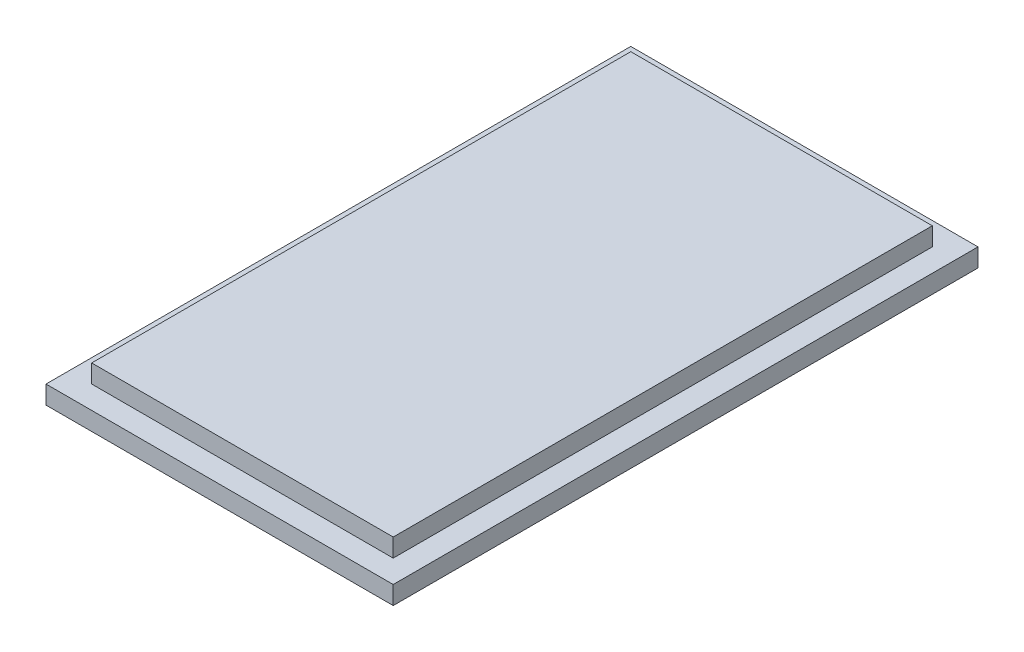
ISO-10303-21;
HEADER;
FILE_DESCRIPTION(('STEP AP214'),'2;1');
FILE_NAME('part.step','',(''),(''),'','','');
FILE_SCHEMA(('AUTOMOTIVE_DESIGN { 1 0 10303 214 1 1 1 1 }'));
ENDSEC;
DATA;
#1=APPLICATION_CONTEXT('core data for automotive mechanical design processes');
#2=APPLICATION_PROTOCOL_DEFINITION('international standard','automotive_design',2000,#1);
#3=PRODUCT_CONTEXT('',#1,'mechanical');
#4=PRODUCT('Part','Part','',(#3));
#5=PRODUCT_RELATED_PRODUCT_CATEGORY('part','',(#4));
#6=PRODUCT_DEFINITION_FORMATION('','',#4);
#7=PRODUCT_DEFINITION_CONTEXT('part definition',#1,'design');
#8=PRODUCT_DEFINITION('design','',#6,#7);
#9=PRODUCT_DEFINITION_SHAPE('','',#8);
#10=(LENGTH_UNIT() NAMED_UNIT(*) SI_UNIT(.MILLI.,.METRE.));
#11=(NAMED_UNIT(*) PLANE_ANGLE_UNIT() SI_UNIT($,.RADIAN.));
#12=(NAMED_UNIT(*) SI_UNIT($,.STERADIAN.) SOLID_ANGLE_UNIT());
#13=UNCERTAINTY_MEASURE_WITH_UNIT(LENGTH_MEASURE(1.E-05),#10,'distance_accuracy_value','');
#14=(GEOMETRIC_REPRESENTATION_CONTEXT(3) GLOBAL_UNCERTAINTY_ASSIGNED_CONTEXT((#13)) GLOBAL_UNIT_ASSIGNED_CONTEXT((#10,
#11,#12)) REPRESENTATION_CONTEXT('',''));
#15=CARTESIAN_POINT('',(0.,0.,0.));
#16=DIRECTION('',(0.,0.,1.));
#17=DIRECTION('',(1.,0.,0.));
#18=AXIS2_PLACEMENT_3D('',#15,#16,#17);
#19=CARTESIAN_POINT('',(0.,1.,0.));
#20=DIRECTION('',(0.,-1.,0.));
#21=DIRECTION('',(0.,0.,-1.));
#22=AXIS2_PLACEMENT_3D('',#19,#20,#21);
#23=PLANE('',#22);
#24=DIRECTION('',(0.,0.,1.));
#25=VECTOR('',#24,1.);
#26=CARTESIAN_POINT('',(0.,1.,0.));
#27=LINE('',#26,#25);
#28=CARTESIAN_POINT('',(0.,1.,-32.));
#29=VERTEX_POINT('',#28);
#30=CARTESIAN_POINT('',(0.,1.,0.));
#31=VERTEX_POINT('',#30);
#32=EDGE_CURVE('E173',#29,#31,#27,.T.);
#33=ORIENTED_EDGE('',*,*,#32,.T.);
#34=DIRECTION('',(1.,0.,0.));
#35=VECTOR('',#34,1.);
#36=CARTESIAN_POINT('',(0.,1.,0.));
#37=LINE('',#36,#35);
#38=CARTESIAN_POINT('',(19.,1.,0.));
#39=VERTEX_POINT('',#38);
#40=EDGE_CURVE('E90',#31,#39,#37,.T.);
#41=ORIENTED_EDGE('',*,*,#40,.T.);
#42=DIRECTION('',(0.,0.,-1.));
#43=VECTOR('',#42,1.);
#44=CARTESIAN_POINT('',(19.,1.,0.));
#45=LINE('',#44,#43);
#46=CARTESIAN_POINT('',(19.,1.,-32.));
#47=VERTEX_POINT('',#46);
#48=EDGE_CURVE('E178',#39,#47,#45,.T.);
#49=ORIENTED_EDGE('',*,*,#48,.T.);
#50=DIRECTION('',(-1.,0.,0.));
#51=VECTOR('',#50,1.);
#52=CARTESIAN_POINT('',(0.,1.,-32.));
#53=LINE('',#52,#51);
#54=EDGE_CURVE('E59',#47,#29,#53,.T.);
#55=ORIENTED_EDGE('',*,*,#54,.T.);
#56=EDGE_LOOP('',(#33,#41,#49,#55));
#57=FACE_BOUND('',#56,.T.);
#58=DIRECTION('',(1.,0.,0.));
#59=VECTOR('',#58,1.);
#60=CARTESIAN_POINT('',(1.25,1.,-1.25));
#61=LINE('',#60,#59);
#62=CARTESIAN_POINT('',(1.25,1.,-1.25));
#63=VERTEX_POINT('',#62);
#64=CARTESIAN_POINT('',(17.75,1.,-1.25));
#65=VERTEX_POINT('',#64);
#66=EDGE_CURVE('E129',#63,#65,#61,.T.);
#67=ORIENTED_EDGE('',*,*,#66,.F.);
#68=DIRECTION('',(0.,0.,1.));
#69=VECTOR('',#68,1.);
#70=CARTESIAN_POINT('',(1.25,1.,-1.25));
#71=LINE('',#70,#69);
#72=CARTESIAN_POINT('',(1.25,1.,-30.75));
#73=VERTEX_POINT('',#72);
#74=EDGE_CURVE('E125',#73,#63,#71,.T.);
#75=ORIENTED_EDGE('',*,*,#74,.F.);
#76=DIRECTION('',(-1.,0.,0.));
#77=VECTOR('',#76,1.);
#78=CARTESIAN_POINT('',(1.25,1.,-30.75));
#79=LINE('',#78,#77);
#80=CARTESIAN_POINT('',(17.75,1.,-30.75));
#81=VERTEX_POINT('',#80);
#82=EDGE_CURVE('E166',#81,#73,#79,.T.);
#83=ORIENTED_EDGE('',*,*,#82,.F.);
#84=DIRECTION('',(0.,0.,-1.));
#85=VECTOR('',#84,1.);
#86=CARTESIAN_POINT('',(17.75,1.,-1.25));
#87=LINE('',#86,#85);
#88=EDGE_CURVE('E162',#65,#81,#87,.T.);
#89=ORIENTED_EDGE('',*,*,#88,.F.);
#90=EDGE_LOOP('',(#67,#75,#83,#89));
#91=FACE_BOUND('',#90,.T.);
#92=ADVANCED_FACE('F41',(#57,#91),#23,.F.);
#93=CARTESIAN_POINT('',(0.,0.,0.));
#94=DIRECTION('',(0.,-1.,0.));
#95=DIRECTION('',(0.,0.,-1.));
#96=AXIS2_PLACEMENT_3D('',#93,#94,#95);
#97=PLANE('',#96);
#98=DIRECTION('',(0.,0.,1.));
#99=VECTOR('',#98,1.);
#100=CARTESIAN_POINT('',(0.,0.,0.));
#101=LINE('',#100,#99);
#102=CARTESIAN_POINT('',(0.,0.,-32.));
#103=VERTEX_POINT('',#102);
#104=CARTESIAN_POINT('',(0.,0.,0.));
#105=VERTEX_POINT('',#104);
#106=EDGE_CURVE('E172',#103,#105,#101,.T.);
#107=ORIENTED_EDGE('',*,*,#106,.F.);
#108=DIRECTION('',(-1.,0.,0.));
#109=VECTOR('',#108,1.);
#110=CARTESIAN_POINT('',(0.,0.,-32.));
#111=LINE('',#110,#109);
#112=CARTESIAN_POINT('',(19.,0.,-32.));
#113=VERTEX_POINT('',#112);
#114=EDGE_CURVE('E83',#113,#103,#111,.T.);
#115=ORIENTED_EDGE('',*,*,#114,.F.);
#116=DIRECTION('',(0.,0.,-1.));
#117=VECTOR('',#116,1.);
#118=CARTESIAN_POINT('',(19.,0.,0.));
#119=LINE('',#118,#117);
#120=CARTESIAN_POINT('',(19.,0.,0.));
#121=VERTEX_POINT('',#120);
#122=EDGE_CURVE('E77',#121,#113,#119,.T.);
#123=ORIENTED_EDGE('',*,*,#122,.F.);
#124=DIRECTION('',(1.,0.,0.));
#125=VECTOR('',#124,1.);
#126=CARTESIAN_POINT('',(0.,0.,0.));
#127=LINE('',#126,#125);
#128=EDGE_CURVE('E187',#105,#121,#127,.T.);
#129=ORIENTED_EDGE('',*,*,#128,.F.);
#130=EDGE_LOOP('',(#107,#115,#123,#129));
#131=FACE_BOUND('',#130,.T.);
#132=ADVANCED_FACE('F203',(#131),#97,.T.);
#133=CARTESIAN_POINT('',(0.,1.,0.));
#134=DIRECTION('',(1.,0.,0.));
#135=DIRECTION('',(0.,0.,-1.));
#136=AXIS2_PLACEMENT_3D('',#133,#134,#135);
#137=PLANE('',#136);
#138=ORIENTED_EDGE('',*,*,#106,.T.);
#139=DIRECTION('',(0.,-1.,0.));
#140=VECTOR('',#139,1.);
#141=CARTESIAN_POINT('',(0.,1.,0.));
#142=LINE('',#141,#140);
#143=EDGE_CURVE('E11',#31,#105,#142,.T.);
#144=ORIENTED_EDGE('',*,*,#143,.F.);
#145=ORIENTED_EDGE('',*,*,#32,.F.);
#146=DIRECTION('',(0.,-1.,0.));
#147=VECTOR('',#146,1.);
#148=CARTESIAN_POINT('',(0.,1.,-32.));
#149=LINE('',#148,#147);
#150=EDGE_CURVE('E183',#29,#103,#149,.T.);
#151=ORIENTED_EDGE('',*,*,#150,.T.);
#152=EDGE_LOOP('',(#138,#144,#145,#151));
#153=FACE_BOUND('',#152,.T.);
#154=ADVANCED_FACE('F43',(#153),#137,.F.);
#155=CARTESIAN_POINT('',(0.,1.,0.));
#156=DIRECTION('',(0.,0.,-1.));
#157=DIRECTION('',(-1.,0.,0.));
#158=AXIS2_PLACEMENT_3D('',#155,#156,#157);
#159=PLANE('',#158);
#160=ORIENTED_EDGE('',*,*,#128,.T.);
#161=DIRECTION('',(0.,-1.,0.));
#162=VECTOR('',#161,1.);
#163=CARTESIAN_POINT('',(19.,1.,0.));
#164=LINE('',#163,#162);
#165=EDGE_CURVE('E51',#39,#121,#164,.T.);
#166=ORIENTED_EDGE('',*,*,#165,.F.);
#167=ORIENTED_EDGE('',*,*,#40,.F.);
#168=ORIENTED_EDGE('',*,*,#143,.T.);
#169=EDGE_LOOP('',(#160,#166,#167,#168));
#170=FACE_BOUND('',#169,.T.);
#171=ADVANCED_FACE('F216',(#170),#159,.F.);
#172=CARTESIAN_POINT('',(19.,1.,0.));
#173=DIRECTION('',(-1.,0.,0.));
#174=DIRECTION('',(0.,0.,1.));
#175=AXIS2_PLACEMENT_3D('',#172,#173,#174);
#176=PLANE('',#175);
#177=ORIENTED_EDGE('',*,*,#122,.T.);
#178=DIRECTION('',(0.,-1.,0.));
#179=VECTOR('',#178,1.);
#180=CARTESIAN_POINT('',(19.,1.,-32.));
#181=LINE('',#180,#179);
#182=EDGE_CURVE('E196',#47,#113,#181,.T.);
#183=ORIENTED_EDGE('',*,*,#182,.F.);
#184=ORIENTED_EDGE('',*,*,#48,.F.);
#185=ORIENTED_EDGE('',*,*,#165,.T.);
#186=EDGE_LOOP('',(#177,#183,#184,#185));
#187=FACE_BOUND('',#186,.T.);
#188=ADVANCED_FACE('F200',(#187),#176,.F.);
#189=CARTESIAN_POINT('',(0.,1.,-32.));
#190=DIRECTION('',(0.,0.,1.));
#191=DIRECTION('',(1.,0.,0.));
#192=AXIS2_PLACEMENT_3D('',#189,#190,#191);
#193=PLANE('',#192);
#194=ORIENTED_EDGE('',*,*,#114,.T.);
#195=ORIENTED_EDGE('',*,*,#150,.F.);
#196=ORIENTED_EDGE('',*,*,#54,.F.);
#197=ORIENTED_EDGE('',*,*,#182,.T.);
#198=EDGE_LOOP('',(#194,#195,#196,#197));
#199=FACE_BOUND('',#198,.T.);
#200=ADVANCED_FACE('F207',(#199),#193,.F.);
#201=CARTESIAN_POINT('',(1.25,2.,0.));
#202=DIRECTION('',(-1.,0.,0.));
#203=DIRECTION('',(0.,0.,1.));
#204=AXIS2_PLACEMENT_3D('',#201,#202,#203);
#205=PLANE('',#204);
#206=ORIENTED_EDGE('',*,*,#74,.T.);
#207=DIRECTION('',(0.,-1.,0.));
#208=VECTOR('',#207,1.);
#209=CARTESIAN_POINT('',(1.25,2.,-1.25));
#210=LINE('',#209,#208);
#211=CARTESIAN_POINT('',(1.25,2.,-1.25));
#212=VERTEX_POINT('',#211);
#213=EDGE_CURVE('E118',#212,#63,#210,.T.);
#214=ORIENTED_EDGE('',*,*,#213,.F.);
#215=DIRECTION('',(0.,0.,-1.));
#216=VECTOR('',#215,1.);
#217=CARTESIAN_POINT('',(1.25,2.,0.));
#218=LINE('',#217,#216);
#219=CARTESIAN_POINT('',(1.25,2.,-30.75));
#220=VERTEX_POINT('',#219);
#221=EDGE_CURVE('E123',#212,#220,#218,.T.);
#222=ORIENTED_EDGE('',*,*,#221,.T.);
#223=DIRECTION('',(0.,-1.,0.));
#224=VECTOR('',#223,1.);
#225=CARTESIAN_POINT('',(1.25,2.,-30.75));
#226=LINE('',#225,#224);
#227=EDGE_CURVE('E151',#220,#73,#226,.T.);
#228=ORIENTED_EDGE('',*,*,#227,.T.);
#229=EDGE_LOOP('',(#206,#214,#222,#228));
#230=FACE_BOUND('',#229,.T.);
#231=ADVANCED_FACE('F120',(#230),#205,.T.);
#232=CARTESIAN_POINT('',(17.75,2.,0.));
#233=DIRECTION('',(-1.,0.,0.));
#234=DIRECTION('',(0.,0.,1.));
#235=AXIS2_PLACEMENT_3D('',#232,#233,#234);
#236=PLANE('',#235);
#237=DIRECTION('',(0.,-1.,0.));
#238=VECTOR('',#237,1.);
#239=CARTESIAN_POINT('',(17.75,2.,-1.25));
#240=LINE('',#239,#238);
#241=CARTESIAN_POINT('',(17.75,2.,-1.25));
#242=VERTEX_POINT('',#241);
#243=EDGE_CURVE('E130',#242,#65,#240,.T.);
#244=ORIENTED_EDGE('',*,*,#243,.T.);
#245=ORIENTED_EDGE('',*,*,#88,.T.);
#246=DIRECTION('',(0.,-1.,0.));
#247=VECTOR('',#246,1.);
#248=CARTESIAN_POINT('',(17.75,2.,-30.75));
#249=LINE('',#248,#247);
#250=CARTESIAN_POINT('',(17.75,2.,-30.75));
#251=VERTEX_POINT('',#250);
#252=EDGE_CURVE('E154',#251,#81,#249,.T.);
#253=ORIENTED_EDGE('',*,*,#252,.F.);
#254=DIRECTION('',(0.,0.,-1.));
#255=VECTOR('',#254,1.);
#256=CARTESIAN_POINT('',(17.75,2.,0.));
#257=LINE('',#256,#255);
#258=EDGE_CURVE('E139',#242,#251,#257,.T.);
#259=ORIENTED_EDGE('',*,*,#258,.F.);
#260=EDGE_LOOP('',(#244,#245,#253,#259));
#261=FACE_BOUND('',#260,.T.);
#262=ADVANCED_FACE('F214',(#261),#236,.F.);
#263=CARTESIAN_POINT('',(0.,2.,-1.25));
#264=DIRECTION('',(0.,0.,-1.));
#265=DIRECTION('',(-1.,0.,0.));
#266=AXIS2_PLACEMENT_3D('',#263,#264,#265);
#267=PLANE('',#266);
#268=ORIENTED_EDGE('',*,*,#213,.T.);
#269=ORIENTED_EDGE('',*,*,#66,.T.);
#270=ORIENTED_EDGE('',*,*,#243,.F.);
#271=DIRECTION('',(1.,0.,0.));
#272=VECTOR('',#271,1.);
#273=CARTESIAN_POINT('',(0.,2.,-1.25));
#274=LINE('',#273,#272);
#275=EDGE_CURVE('E133',#212,#242,#274,.T.);
#276=ORIENTED_EDGE('',*,*,#275,.F.);
#277=EDGE_LOOP('',(#268,#269,#270,#276));
#278=FACE_BOUND('',#277,.T.);
#279=ADVANCED_FACE('F134',(#278),#267,.F.);
#280=CARTESIAN_POINT('',(0.,2.,-30.75));
#281=DIRECTION('',(0.,0.,-1.));
#282=DIRECTION('',(-1.,0.,0.));
#283=AXIS2_PLACEMENT_3D('',#280,#281,#282);
#284=PLANE('',#283);
#285=ORIENTED_EDGE('',*,*,#82,.T.);
#286=ORIENTED_EDGE('',*,*,#227,.F.);
#287=DIRECTION('',(1.,0.,0.));
#288=VECTOR('',#287,1.);
#289=CARTESIAN_POINT('',(0.,2.,-30.75));
#290=LINE('',#289,#288);
#291=EDGE_CURVE('E143',#220,#251,#290,.T.);
#292=ORIENTED_EDGE('',*,*,#291,.T.);
#293=ORIENTED_EDGE('',*,*,#252,.T.);
#294=EDGE_LOOP('',(#285,#286,#292,#293));
#295=FACE_BOUND('',#294,.T.);
#296=ADVANCED_FACE('F228',(#295),#284,.T.);
#297=CARTESIAN_POINT('',(0.,2.,0.));
#298=DIRECTION('',(0.,1.,0.));
#299=DIRECTION('',(0.,0.,1.));
#300=AXIS2_PLACEMENT_3D('',#297,#298,#299);
#301=PLANE('',#300);
#302=ORIENTED_EDGE('',*,*,#221,.F.);
#303=ORIENTED_EDGE('',*,*,#275,.T.);
#304=ORIENTED_EDGE('',*,*,#258,.T.);
#305=ORIENTED_EDGE('',*,*,#291,.F.);
#306=EDGE_LOOP('',(#302,#303,#304,#305));
#307=FACE_BOUND('',#306,.T.);
#308=ADVANCED_FACE('F141',(#307),#301,.T.);
#309=CLOSED_SHELL('',(#92,#132,#154,#171,#188,#200,#231,#262,#279,#296,#308));
#310=MANIFOLD_SOLID_BREP('B2',#309);
#311=ADVANCED_BREP_SHAPE_REPRESENTATION('',(#18,#310),#14);
#312=SHAPE_DEFINITION_REPRESENTATION(#9,#311);
ENDSEC;
END-ISO-10303-21;
